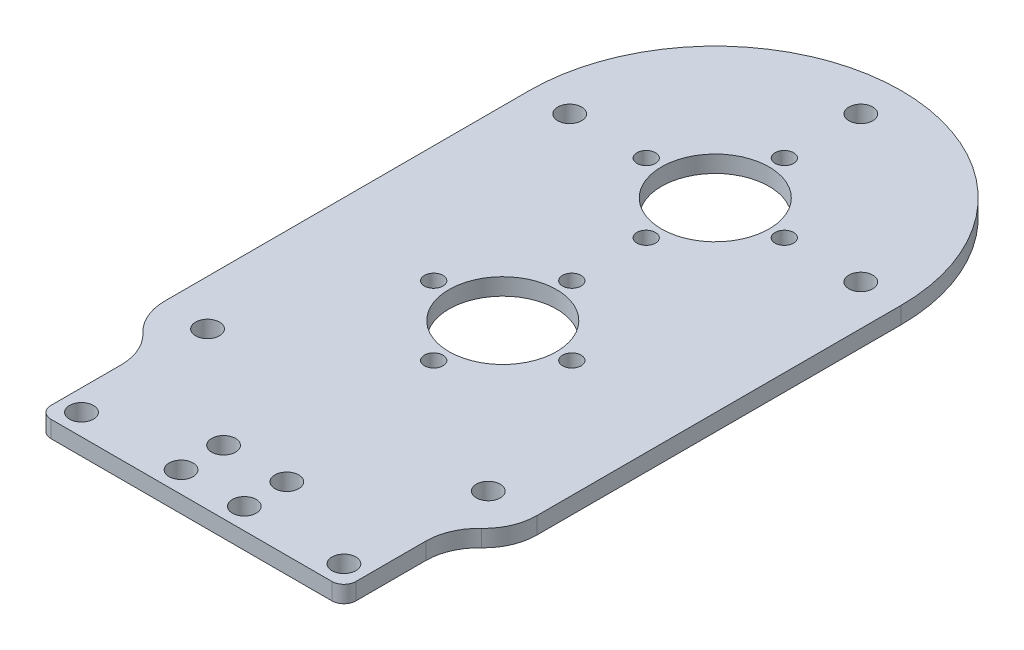
ISO-10303-21;
HEADER;
FILE_DESCRIPTION(('STEP AP214'),'2;1');
FILE_NAME('part.step','',(''),(''),'','','');
FILE_SCHEMA(('AUTOMOTIVE_DESIGN { 1 0 10303 214 1 1 1 1 }'));
ENDSEC;
DATA;
#1=APPLICATION_CONTEXT('core data for automotive mechanical design processes');
#2=APPLICATION_PROTOCOL_DEFINITION('international standard','automotive_design',2000,#1);
#3=PRODUCT_CONTEXT('',#1,'mechanical');
#4=PRODUCT('Part','Part','',(#3));
#5=PRODUCT_RELATED_PRODUCT_CATEGORY('part','',(#4));
#6=PRODUCT_DEFINITION_FORMATION('','',#4);
#7=PRODUCT_DEFINITION_CONTEXT('part definition',#1,'design');
#8=PRODUCT_DEFINITION('design','',#6,#7);
#9=PRODUCT_DEFINITION_SHAPE('','',#8);
#10=(LENGTH_UNIT() NAMED_UNIT(*) SI_UNIT(.MILLI.,.METRE.));
#11=(NAMED_UNIT(*) PLANE_ANGLE_UNIT() SI_UNIT($,.RADIAN.));
#12=(NAMED_UNIT(*) SI_UNIT($,.STERADIAN.) SOLID_ANGLE_UNIT());
#13=UNCERTAINTY_MEASURE_WITH_UNIT(LENGTH_MEASURE(1.E-05),#10,'distance_accuracy_value','');
#14=(GEOMETRIC_REPRESENTATION_CONTEXT(3) GLOBAL_UNCERTAINTY_ASSIGNED_CONTEXT((#13)) GLOBAL_UNIT_ASSIGNED_CONTEXT((#10,
#11,#12)) REPRESENTATION_CONTEXT('',''));
#15=CARTESIAN_POINT('',(0.,0.,0.));
#16=DIRECTION('',(0.,0.,1.));
#17=DIRECTION('',(1.,0.,0.));
#18=AXIS2_PLACEMENT_3D('',#15,#16,#17);
#19=CARTESIAN_POINT('',(38.7,217.525,43.1708613334971));
#20=DIRECTION('',(0.,1.,0.));
#21=DIRECTION('',(0.,0.,1.));
#22=AXIS2_PLACEMENT_3D('',#19,#20,#21);
#23=CYLINDRICAL_SURFACE('',#22,9.99999999999999);
#24=CARTESIAN_POINT('',(38.7,220.7,43.1708613334971));
#25=DIRECTION('',(0.,-1.,0.));
#26=DIRECTION('',(0.,0.,1.));
#27=AXIS2_PLACEMENT_3D('',#24,#25,#26);
#28=CIRCLE('',#27,9.99999999999999);
#29=CARTESIAN_POINT('',(28.7,220.7,43.1708613334971));
#30=VERTEX_POINT('',#29);
#31=CARTESIAN_POINT('',(31.85,220.7,35.8854306667485));
#32=VERTEX_POINT('',#31);
#33=EDGE_CURVE('E160',#30,#32,#28,.T.);
#34=ORIENTED_EDGE('',*,*,#33,.F.);
#35=DIRECTION('',(0.,1.,0.));
#36=VECTOR('',#35,1.);
#37=CARTESIAN_POINT('',(28.7,217.525,43.1708613334971));
#38=LINE('',#37,#36);
#39=CARTESIAN_POINT('',(28.7,217.525,43.1708613334971));
#40=VERTEX_POINT('',#39);
#41=EDGE_CURVE('E11',#40,#30,#38,.T.);
#42=ORIENTED_EDGE('',*,*,#41,.F.);
#43=CARTESIAN_POINT('',(38.7,217.525,43.1708613334971));
#44=DIRECTION('',(0.,-1.,0.));
#45=DIRECTION('',(0.,0.,1.));
#46=AXIS2_PLACEMENT_3D('',#43,#44,#45);
#47=CIRCLE('',#46,9.99999999999999);
#48=CARTESIAN_POINT('',(31.85,217.525,35.8854306667485));
#49=VERTEX_POINT('',#48);
#50=EDGE_CURVE('E193',#40,#49,#47,.T.);
#51=ORIENTED_EDGE('',*,*,#50,.T.);
#52=DIRECTION('',(0.,1.,0.));
#53=VECTOR('',#52,1.);
#54=CARTESIAN_POINT('',(31.85,217.525,35.8854306667485));
#55=LINE('',#54,#53);
#56=EDGE_CURVE('E42',#49,#32,#55,.T.);
#57=ORIENTED_EDGE('',*,*,#56,.T.);
#58=EDGE_LOOP('',(#34,#42,#51,#57));
#59=FACE_BOUND('',#58,.T.);
#60=ADVANCED_FACE('F39',(#59),#23,.F.);
#61=CARTESIAN_POINT('',(28.7,217.525,43.1708613334971));
#62=DIRECTION('',(1.,0.,0.));
#63=DIRECTION('',(0.,0.,-1.));
#64=AXIS2_PLACEMENT_3D('',#61,#62,#63);
#65=PLANE('',#64);
#66=DIRECTION('',(0.,0.,-1.));
#67=VECTOR('',#66,1.);
#68=CARTESIAN_POINT('',(28.7,220.7,43.1708613334971));
#69=LINE('',#68,#67);
#70=CARTESIAN_POINT('',(28.7,220.7,56.35));
#71=VERTEX_POINT('',#70);
#72=EDGE_CURVE('E191',#71,#30,#69,.T.);
#73=ORIENTED_EDGE('',*,*,#72,.F.);
#74=DIRECTION('',(0.,1.,0.));
#75=VECTOR('',#74,1.);
#76=CARTESIAN_POINT('',(28.7,217.525,56.35));
#77=LINE('',#76,#75);
#78=CARTESIAN_POINT('',(28.7,217.525,56.35));
#79=VERTEX_POINT('',#78);
#80=EDGE_CURVE('E48',#79,#71,#77,.T.);
#81=ORIENTED_EDGE('',*,*,#80,.F.);
#82=DIRECTION('',(0.,0.,-1.));
#83=VECTOR('',#82,1.);
#84=CARTESIAN_POINT('',(28.7,217.525,43.1708613334971));
#85=LINE('',#84,#83);
#86=EDGE_CURVE('E150',#79,#40,#85,.T.);
#87=ORIENTED_EDGE('',*,*,#86,.T.);
#88=ORIENTED_EDGE('',*,*,#41,.T.);
#89=EDGE_LOOP('',(#73,#81,#87,#88));
#90=FACE_BOUND('',#89,.T.);
#91=ADVANCED_FACE('F214',(#90),#65,.T.);
#92=CARTESIAN_POINT('',(26.45,217.525,56.35));
#93=DIRECTION('',(0.,1.,0.));
#94=DIRECTION('',(0.,0.,1.));
#95=AXIS2_PLACEMENT_3D('',#92,#93,#94);
#96=CYLINDRICAL_SURFACE('',#95,2.25);
#97=CARTESIAN_POINT('',(26.45,220.7,56.35));
#98=DIRECTION('',(0.,1.,0.));
#99=DIRECTION('',(0.,0.,1.));
#100=AXIS2_PLACEMENT_3D('',#97,#98,#99);
#101=CIRCLE('',#100,2.25);
#102=CARTESIAN_POINT('',(26.45,220.7,58.6));
#103=VERTEX_POINT('',#102);
#104=EDGE_CURVE('E137',#103,#71,#101,.T.);
#105=ORIENTED_EDGE('',*,*,#104,.F.);
#106=DIRECTION('',(0.,1.,0.));
#107=VECTOR('',#106,1.);
#108=CARTESIAN_POINT('',(26.45,217.525,58.6));
#109=LINE('',#108,#107);
#110=CARTESIAN_POINT('',(26.45,217.525,58.6));
#111=VERTEX_POINT('',#110);
#112=EDGE_CURVE('E132',#111,#103,#109,.T.);
#113=ORIENTED_EDGE('',*,*,#112,.F.);
#114=CARTESIAN_POINT('',(26.45,217.525,56.35));
#115=DIRECTION('',(0.,1.,0.));
#116=DIRECTION('',(0.,0.,1.));
#117=AXIS2_PLACEMENT_3D('',#114,#115,#116);
#118=CIRCLE('',#117,2.25);
#119=EDGE_CURVE('E135',#111,#79,#118,.T.);
#120=ORIENTED_EDGE('',*,*,#119,.T.);
#121=ORIENTED_EDGE('',*,*,#80,.T.);
#122=EDGE_LOOP('',(#105,#113,#120,#121));
#123=FACE_BOUND('',#122,.T.);
#124=ADVANCED_FACE('F134',(#123),#96,.T.);
#125=CARTESIAN_POINT('',(-26.45,217.525,58.6));
#126=DIRECTION('',(0.,0.,1.));
#127=DIRECTION('',(1.,0.,0.));
#128=AXIS2_PLACEMENT_3D('',#125,#126,#127);
#129=PLANE('',#128);
#130=DIRECTION('',(1.,0.,0.));
#131=VECTOR('',#130,1.);
#132=CARTESIAN_POINT('',(-26.45,220.7,58.6));
#133=LINE('',#132,#131);
#134=CARTESIAN_POINT('',(-26.45,220.7,58.6));
#135=VERTEX_POINT('',#134);
#136=EDGE_CURVE('E188',#135,#103,#133,.T.);
#137=ORIENTED_EDGE('',*,*,#136,.F.);
#138=DIRECTION('',(0.,1.,0.));
#139=VECTOR('',#138,1.);
#140=CARTESIAN_POINT('',(-26.45,217.525,58.6));
#141=LINE('',#140,#139);
#142=CARTESIAN_POINT('',(-26.45,217.525,58.6));
#143=VERTEX_POINT('',#142);
#144=EDGE_CURVE('E142',#143,#135,#141,.T.);
#145=ORIENTED_EDGE('',*,*,#144,.F.);
#146=DIRECTION('',(1.,0.,0.));
#147=VECTOR('',#146,1.);
#148=CARTESIAN_POINT('',(-26.45,217.525,58.6));
#149=LINE('',#148,#147);
#150=EDGE_CURVE('E148',#143,#111,#149,.T.);
#151=ORIENTED_EDGE('',*,*,#150,.T.);
#152=ORIENTED_EDGE('',*,*,#112,.T.);
#153=EDGE_LOOP('',(#137,#145,#151,#152));
#154=FACE_BOUND('',#153,.T.);
#155=ADVANCED_FACE('F152',(#154),#129,.T.);
#156=CARTESIAN_POINT('',(-26.45,217.525,56.35));
#157=DIRECTION('',(0.,1.,0.));
#158=DIRECTION('',(0.,0.,1.));
#159=AXIS2_PLACEMENT_3D('',#156,#157,#158);
#160=CYLINDRICAL_SURFACE('',#159,2.25);
#161=CARTESIAN_POINT('',(-26.45,220.7,56.35));
#162=DIRECTION('',(0.,1.,0.));
#163=DIRECTION('',(0.,0.,1.));
#164=AXIS2_PLACEMENT_3D('',#161,#162,#163);
#165=CIRCLE('',#164,2.25);
#166=CARTESIAN_POINT('',(-28.7,220.7,56.35));
#167=VERTEX_POINT('',#166);
#168=EDGE_CURVE('E185',#167,#135,#165,.T.);
#169=ORIENTED_EDGE('',*,*,#168,.F.);
#170=DIRECTION('',(0.,1.,0.));
#171=VECTOR('',#170,1.);
#172=CARTESIAN_POINT('',(-28.7,217.525,56.35));
#173=LINE('',#172,#171);
#174=CARTESIAN_POINT('',(-28.7,217.525,56.35));
#175=VERTEX_POINT('',#174);
#176=EDGE_CURVE('E197',#175,#167,#173,.T.);
#177=ORIENTED_EDGE('',*,*,#176,.F.);
#178=CARTESIAN_POINT('',(-26.45,217.525,56.35));
#179=DIRECTION('',(0.,1.,0.));
#180=DIRECTION('',(0.,0.,1.));
#181=AXIS2_PLACEMENT_3D('',#178,#179,#180);
#182=CIRCLE('',#181,2.25);
#183=EDGE_CURVE('E153',#175,#143,#182,.T.);
#184=ORIENTED_EDGE('',*,*,#183,.T.);
#185=ORIENTED_EDGE('',*,*,#144,.T.);
#186=EDGE_LOOP('',(#169,#177,#184,#185));
#187=FACE_BOUND('',#186,.T.);
#188=ADVANCED_FACE('F227',(#187),#160,.T.);
#189=CARTESIAN_POINT('',(-28.7,217.525,43.1708613334971));
#190=DIRECTION('',(-1.,0.,0.));
#191=DIRECTION('',(0.,0.,1.));
#192=AXIS2_PLACEMENT_3D('',#189,#190,#191);
#193=PLANE('',#192);
#194=DIRECTION('',(0.,0.,1.));
#195=VECTOR('',#194,1.);
#196=CARTESIAN_POINT('',(-28.7,220.7,43.1708613334971));
#197=LINE('',#196,#195);
#198=CARTESIAN_POINT('',(-28.7,220.7,43.1708613334971));
#199=VERTEX_POINT('',#198);
#200=EDGE_CURVE('E182',#199,#167,#197,.T.);
#201=ORIENTED_EDGE('',*,*,#200,.F.);
#202=DIRECTION('',(0.,1.,0.));
#203=VECTOR('',#202,1.);
#204=CARTESIAN_POINT('',(-28.7,217.525,43.1708613334971));
#205=LINE('',#204,#203);
#206=CARTESIAN_POINT('',(-28.7,217.525,43.1708613334971));
#207=VERTEX_POINT('',#206);
#208=EDGE_CURVE('E199',#207,#199,#205,.T.);
#209=ORIENTED_EDGE('',*,*,#208,.F.);
#210=DIRECTION('',(0.,0.,1.));
#211=VECTOR('',#210,1.);
#212=CARTESIAN_POINT('',(-28.7,217.525,43.1708613334971));
#213=LINE('',#212,#211);
#214=EDGE_CURVE('E155',#207,#175,#213,.T.);
#215=ORIENTED_EDGE('',*,*,#214,.T.);
#216=ORIENTED_EDGE('',*,*,#176,.T.);
#217=EDGE_LOOP('',(#201,#209,#215,#216));
#218=FACE_BOUND('',#217,.T.);
#219=ADVANCED_FACE('F230',(#218),#193,.T.);
#220=CARTESIAN_POINT('',(-38.7,217.525,43.1708613334971));
#221=DIRECTION('',(0.,1.,0.));
#222=DIRECTION('',(0.,0.,1.));
#223=AXIS2_PLACEMENT_3D('',#220,#221,#222);
#224=CYLINDRICAL_SURFACE('',#223,9.99999999999999);
#225=CARTESIAN_POINT('',(-38.7,220.7,43.1708613334971));
#226=DIRECTION('',(0.,-1.,0.));
#227=DIRECTION('',(0.,0.,1.));
#228=AXIS2_PLACEMENT_3D('',#225,#226,#227);
#229=CIRCLE('',#228,9.99999999999999);
#230=CARTESIAN_POINT('',(-31.85,220.7,35.8854306667485));
#231=VERTEX_POINT('',#230);
#232=EDGE_CURVE('E179',#231,#199,#229,.T.);
#233=ORIENTED_EDGE('',*,*,#232,.F.);
#234=DIRECTION('',(0.,1.,0.));
#235=VECTOR('',#234,1.);
#236=CARTESIAN_POINT('',(-31.85,217.525,35.8854306667485));
#237=LINE('',#236,#235);
#238=CARTESIAN_POINT('',(-31.85,217.525,35.8854306667485));
#239=VERTEX_POINT('',#238);
#240=EDGE_CURVE('E201',#239,#231,#237,.T.);
#241=ORIENTED_EDGE('',*,*,#240,.F.);
#242=CARTESIAN_POINT('',(-38.7,217.525,43.1708613334971));
#243=DIRECTION('',(0.,-1.,0.));
#244=DIRECTION('',(0.,0.,1.));
#245=AXIS2_PLACEMENT_3D('',#242,#243,#244);
#246=CIRCLE('',#245,9.99999999999999);
#247=EDGE_CURVE('E492',#239,#207,#246,.T.);
#248=ORIENTED_EDGE('',*,*,#247,.T.);
#249=ORIENTED_EDGE('',*,*,#208,.T.);
#250=EDGE_LOOP('',(#233,#241,#248,#249));
#251=FACE_BOUND('',#250,.T.);
#252=ADVANCED_FACE('F234',(#251),#224,.F.);
#253=CARTESIAN_POINT('',(-25.,217.525,28.6));
#254=DIRECTION('',(0.,1.,0.));
#255=DIRECTION('',(0.,0.,1.));
#256=AXIS2_PLACEMENT_3D('',#253,#254,#255);
#257=CYLINDRICAL_SURFACE('',#256,10.);
#258=CARTESIAN_POINT('',(-25.,220.7,28.6));
#259=DIRECTION('',(0.,1.,0.));
#260=DIRECTION('',(0.,0.,1.));
#261=AXIS2_PLACEMENT_3D('',#258,#259,#260);
#262=CIRCLE('',#261,10.);
#263=CARTESIAN_POINT('',(-35.,220.7,28.5999999999999));
#264=VERTEX_POINT('',#263);
#265=EDGE_CURVE('E176',#264,#231,#262,.T.);
#266=ORIENTED_EDGE('',*,*,#265,.F.);
#267=DIRECTION('',(0.,1.,0.));
#268=VECTOR('',#267,1.);
#269=CARTESIAN_POINT('',(-35.,217.525,28.5999999999999));
#270=LINE('',#269,#268);
#271=CARTESIAN_POINT('',(-35.,217.525,28.5999999999999));
#272=VERTEX_POINT('',#271);
#273=EDGE_CURVE('E203',#272,#264,#270,.T.);
#274=ORIENTED_EDGE('',*,*,#273,.F.);
#275=CARTESIAN_POINT('',(-25.,217.525,28.6));
#276=DIRECTION('',(0.,1.,0.));
#277=DIRECTION('',(0.,0.,1.));
#278=AXIS2_PLACEMENT_3D('',#275,#276,#277);
#279=CIRCLE('',#278,10.);
#280=EDGE_CURVE('E489',#272,#239,#279,.T.);
#281=ORIENTED_EDGE('',*,*,#280,.T.);
#282=ORIENTED_EDGE('',*,*,#240,.T.);
#283=EDGE_LOOP('',(#266,#274,#281,#282));
#284=FACE_BOUND('',#283,.T.);
#285=ADVANCED_FACE('F238',(#284),#257,.T.);
#286=CARTESIAN_POINT('',(-35.,217.525,28.5963697313921));
#287=DIRECTION('',(-1.,0.,-1.9113995832185E-12));
#288=DIRECTION('',(-1.9113995832185E-12,0.,1.));
#289=AXIS2_PLACEMENT_3D('',#286,#287,#288);
#290=PLANE('',#289);
#291=DIRECTION('',(-1.9113995832185E-12,0.,1.));
#292=VECTOR('',#291,1.);
#293=CARTESIAN_POINT('',(-35.,220.7,28.5963697313921));
#294=LINE('',#293,#292);
#295=CARTESIAN_POINT('',(-35.,220.7,-40.));
#296=VERTEX_POINT('',#295);
#297=EDGE_CURVE('E173',#296,#264,#294,.T.);
#298=ORIENTED_EDGE('',*,*,#297,.F.);
#299=DIRECTION('',(0.,1.,0.));
#300=VECTOR('',#299,1.);
#301=CARTESIAN_POINT('',(-35.,217.525,-40.));
#302=LINE('',#301,#300);
#303=CARTESIAN_POINT('',(-35.,217.525,-40.));
#304=VERTEX_POINT('',#303);
#305=EDGE_CURVE('E205',#304,#296,#302,.T.);
#306=ORIENTED_EDGE('',*,*,#305,.F.);
#307=DIRECTION('',(0.,0.,1.));
#308=VECTOR('',#307,1.);
#309=CARTESIAN_POINT('',(-35.,217.525,-40.));
#310=LINE('',#309,#308);
#311=EDGE_CURVE('E487',#304,#272,#310,.T.);
#312=ORIENTED_EDGE('',*,*,#311,.T.);
#313=ORIENTED_EDGE('',*,*,#273,.T.);
#314=EDGE_LOOP('',(#298,#306,#312,#313));
#315=FACE_BOUND('',#314,.T.);
#316=ADVANCED_FACE('F242',(#315),#290,.T.);
#317=CARTESIAN_POINT('',(0.,217.525,-40.));
#318=DIRECTION('',(0.,1.,0.));
#319=DIRECTION('',(0.,0.,1.));
#320=AXIS2_PLACEMENT_3D('',#317,#318,#319);
#321=CYLINDRICAL_SURFACE('',#320,35.);
#322=CARTESIAN_POINT('',(0.,220.7,-40.));
#323=DIRECTION('',(0.,1.,0.));
#324=DIRECTION('',(0.,0.,1.));
#325=AXIS2_PLACEMENT_3D('',#322,#323,#324);
#326=CIRCLE('',#325,35.);
#327=CARTESIAN_POINT('',(35.,220.7,-40.));
#328=VERTEX_POINT('',#327);
#329=EDGE_CURVE('E170',#328,#296,#326,.T.);
#330=ORIENTED_EDGE('',*,*,#329,.F.);
#331=DIRECTION('',(0.,1.,0.));
#332=VECTOR('',#331,1.);
#333=CARTESIAN_POINT('',(35.,217.525,-40.));
#334=LINE('',#333,#332);
#335=CARTESIAN_POINT('',(35.,217.525,-40.));
#336=VERTEX_POINT('',#335);
#337=EDGE_CURVE('E208',#336,#328,#334,.T.);
#338=ORIENTED_EDGE('',*,*,#337,.F.);
#339=CARTESIAN_POINT('',(0.,217.525,-40.));
#340=DIRECTION('',(0.,1.,0.));
#341=DIRECTION('',(0.,0.,1.));
#342=AXIS2_PLACEMENT_3D('',#339,#340,#341);
#343=CIRCLE('',#342,35.);
#344=EDGE_CURVE('E484',#336,#304,#343,.T.);
#345=ORIENTED_EDGE('',*,*,#344,.T.);
#346=ORIENTED_EDGE('',*,*,#305,.T.);
#347=EDGE_LOOP('',(#330,#338,#345,#346));
#348=FACE_BOUND('',#347,.T.);
#349=ADVANCED_FACE('F246',(#348),#321,.T.);
#350=CARTESIAN_POINT('',(35.,217.525,-40.));
#351=DIRECTION('',(1.,0.,0.));
#352=DIRECTION('',(0.,0.,-1.));
#353=AXIS2_PLACEMENT_3D('',#350,#351,#352);
#354=PLANE('',#353);
#355=DIRECTION('',(0.,0.,-1.));
#356=VECTOR('',#355,1.);
#357=CARTESIAN_POINT('',(35.,220.7,-40.));
#358=LINE('',#357,#356);
#359=CARTESIAN_POINT('',(35.,220.7,28.6));
#360=VERTEX_POINT('',#359);
#361=EDGE_CURVE('E167',#360,#328,#358,.T.);
#362=ORIENTED_EDGE('',*,*,#361,.F.);
#363=DIRECTION('',(0.,1.,0.));
#364=VECTOR('',#363,1.);
#365=CARTESIAN_POINT('',(35.,217.525,28.6));
#366=LINE('',#365,#364);
#367=CARTESIAN_POINT('',(35.,217.525,28.6));
#368=VERTEX_POINT('',#367);
#369=EDGE_CURVE('E209',#368,#360,#366,.T.);
#370=ORIENTED_EDGE('',*,*,#369,.F.);
#371=DIRECTION('',(0.,0.,-1.));
#372=VECTOR('',#371,1.);
#373=CARTESIAN_POINT('',(35.,217.525,-0.432706106175311));
#374=LINE('',#373,#372);
#375=EDGE_CURVE('E482',#368,#336,#374,.T.);
#376=ORIENTED_EDGE('',*,*,#375,.T.);
#377=ORIENTED_EDGE('',*,*,#337,.T.);
#378=EDGE_LOOP('',(#362,#370,#376,#377));
#379=FACE_BOUND('',#378,.T.);
#380=ADVANCED_FACE('F250',(#379),#354,.T.);
#381=CARTESIAN_POINT('',(25.,217.525,28.6));
#382=DIRECTION('',(0.,1.,0.));
#383=DIRECTION('',(0.,0.,1.));
#384=AXIS2_PLACEMENT_3D('',#381,#382,#383);
#385=CYLINDRICAL_SURFACE('',#384,10.);
#386=CARTESIAN_POINT('',(25.,220.7,28.6));
#387=DIRECTION('',(0.,1.,0.));
#388=DIRECTION('',(0.,0.,1.));
#389=AXIS2_PLACEMENT_3D('',#386,#387,#388);
#390=CIRCLE('',#389,10.);
#391=EDGE_CURVE('E163',#32,#360,#390,.T.);
#392=ORIENTED_EDGE('',*,*,#391,.F.);
#393=ORIENTED_EDGE('',*,*,#56,.F.);
#394=CARTESIAN_POINT('',(25.,217.525,28.6));
#395=DIRECTION('',(0.,1.,0.));
#396=DIRECTION('',(0.,0.,1.));
#397=AXIS2_PLACEMENT_3D('',#394,#395,#396);
#398=CIRCLE('',#397,10.);
#399=EDGE_CURVE('E480',#49,#368,#398,.T.);
#400=ORIENTED_EDGE('',*,*,#399,.T.);
#401=ORIENTED_EDGE('',*,*,#369,.T.);
#402=EDGE_LOOP('',(#392,#393,#400,#401));
#403=FACE_BOUND('',#402,.T.);
#404=ADVANCED_FACE('F211',(#403),#385,.T.);
#405=CARTESIAN_POINT('',(38.7,217.525,43.1708613334971));
#406=DIRECTION('',(0.,1.,0.));
#407=DIRECTION('',(0.,0.,1.));
#408=AXIS2_PLACEMENT_3D('',#405,#406,#407);
#409=PLANE('',#408);
#410=CARTESIAN_POINT('',(-5.94999999999999,217.525,46.6));
#411=DIRECTION('',(0.,1.,0.));
#412=DIRECTION('',(0.,0.,1.));
#413=AXIS2_PLACEMENT_3D('',#410,#411,#412);
#414=CIRCLE('',#413,2.25);
#415=CARTESIAN_POINT('',(-5.94999999999999,217.525,48.85));
#416=VERTEX_POINT('',#415);
#417=EDGE_CURVE('E353',#416,#416,#414,.T.);
#418=ORIENTED_EDGE('',*,*,#417,.T.);
#419=EDGE_LOOP('',(#418));
#420=FACE_BOUND('',#419,.T.);
#421=CARTESIAN_POINT('',(5.94999999999999,217.525,46.6));
#422=DIRECTION('',(0.,1.,0.));
#423=DIRECTION('',(0.,0.,1.));
#424=AXIS2_PLACEMENT_3D('',#421,#422,#423);
#425=CIRCLE('',#424,2.25000000000001);
#426=CARTESIAN_POINT('',(5.94999999999999,217.525,48.85));
#427=VERTEX_POINT('',#426);
#428=EDGE_CURVE('E361',#427,#427,#425,.T.);
#429=ORIENTED_EDGE('',*,*,#428,.T.);
#430=EDGE_LOOP('',(#429));
#431=FACE_BOUND('',#430,.T.);
#432=CARTESIAN_POINT('',(-5.94999999999999,217.525,54.6));
#433=DIRECTION('',(0.,1.,0.));
#434=DIRECTION('',(0.,0.,1.));
#435=AXIS2_PLACEMENT_3D('',#432,#433,#434);
#436=CIRCLE('',#435,2.25);
#437=CARTESIAN_POINT('',(-5.94999999999999,217.525,56.85));
#438=VERTEX_POINT('',#437);
#439=EDGE_CURVE('E367',#438,#438,#436,.T.);
#440=ORIENTED_EDGE('',*,*,#439,.T.);
#441=EDGE_LOOP('',(#440));
#442=FACE_BOUND('',#441,.T.);
#443=CARTESIAN_POINT('',(5.94999999999999,217.525,54.6));
#444=DIRECTION('',(0.,1.,0.));
#445=DIRECTION('',(0.,0.,1.));
#446=AXIS2_PLACEMENT_3D('',#443,#444,#445);
#447=CIRCLE('',#446,2.25000000000001);
#448=CARTESIAN_POINT('',(5.94999999999999,217.525,56.85));
#449=VERTEX_POINT('',#448);
#450=EDGE_CURVE('E373',#449,#449,#447,.T.);
#451=ORIENTED_EDGE('',*,*,#450,.T.);
#452=EDGE_LOOP('',(#451));
#453=FACE_BOUND('',#452,.T.);
#454=CARTESIAN_POINT('',(-27.4,217.525,-40.));
#455=DIRECTION('',(0.,1.,0.));
#456=DIRECTION('',(0.,0.,1.));
#457=AXIS2_PLACEMENT_3D('',#454,#455,#456);
#458=CIRCLE('',#457,2.25);
#459=CARTESIAN_POINT('',(-27.4,217.525,-37.75));
#460=VERTEX_POINT('',#459);
#461=EDGE_CURVE('E379',#460,#460,#458,.T.);
#462=ORIENTED_EDGE('',*,*,#461,.T.);
#463=EDGE_LOOP('',(#462));
#464=FACE_BOUND('',#463,.T.);
#465=CARTESIAN_POINT('',(-13.,217.525,-40.));
#466=DIRECTION('',(0.,1.,0.));
#467=DIRECTION('',(0.,0.,1.));
#468=AXIS2_PLACEMENT_3D('',#465,#466,#467);
#469=CIRCLE('',#468,1.75000000000003);
#470=CARTESIAN_POINT('',(-13.,217.525,-38.25));
#471=VERTEX_POINT('',#470);
#472=EDGE_CURVE('E385',#471,#471,#469,.T.);
#473=ORIENTED_EDGE('',*,*,#472,.T.);
#474=EDGE_LOOP('',(#473));
#475=FACE_BOUND('',#474,.T.);
#476=CARTESIAN_POINT('',(0.,217.525,-40.));
#477=DIRECTION('',(0.,1.,0.));
#478=DIRECTION('',(0.,0.,1.));
#479=AXIS2_PLACEMENT_3D('',#476,#477,#478);
#480=CIRCLE('',#479,10.125);
#481=CARTESIAN_POINT('',(0.,217.525,-29.875));
#482=VERTEX_POINT('',#481);
#483=EDGE_CURVE('E391',#482,#482,#480,.T.);
#484=ORIENTED_EDGE('',*,*,#483,.T.);
#485=EDGE_LOOP('',(#484));
#486=FACE_BOUND('',#485,.T.);
#487=CARTESIAN_POINT('',(0.,217.525,-53.));
#488=DIRECTION('',(0.,1.,0.));
#489=DIRECTION('',(0.,0.,1.));
#490=AXIS2_PLACEMENT_3D('',#487,#488,#489);
#491=CIRCLE('',#490,1.75000000000003);
#492=CARTESIAN_POINT('',(0.,217.525,-51.25));
#493=VERTEX_POINT('',#492);
#494=EDGE_CURVE('E397',#493,#493,#491,.T.);
#495=ORIENTED_EDGE('',*,*,#494,.T.);
#496=EDGE_LOOP('',(#495));
#497=FACE_BOUND('',#496,.T.);
#498=CARTESIAN_POINT('',(0.,217.525,-67.4));
#499=DIRECTION('',(0.,1.,0.));
#500=DIRECTION('',(0.,0.,1.));
#501=AXIS2_PLACEMENT_3D('',#498,#499,#500);
#502=CIRCLE('',#501,2.25);
#503=CARTESIAN_POINT('',(0.,217.525,-65.15));
#504=VERTEX_POINT('',#503);
#505=EDGE_CURVE('E403',#504,#504,#502,.T.);
#506=ORIENTED_EDGE('',*,*,#505,.T.);
#507=EDGE_LOOP('',(#506));
#508=FACE_BOUND('',#507,.T.);
#509=CARTESIAN_POINT('',(13.,217.525,-40.));
#510=DIRECTION('',(0.,1.,0.));
#511=DIRECTION('',(0.,0.,1.));
#512=AXIS2_PLACEMENT_3D('',#509,#510,#511);
#513=CIRCLE('',#512,1.74999999999999);
#514=CARTESIAN_POINT('',(13.,217.525,-38.25));
#515=VERTEX_POINT('',#514);
#516=EDGE_CURVE('E409',#515,#515,#513,.T.);
#517=ORIENTED_EDGE('',*,*,#516,.T.);
#518=EDGE_LOOP('',(#517));
#519=FACE_BOUND('',#518,.T.);
#520=CARTESIAN_POINT('',(27.4,217.525,-40.));
#521=DIRECTION('',(0.,1.,0.));
#522=DIRECTION('',(0.,0.,1.));
#523=AXIS2_PLACEMENT_3D('',#520,#521,#522);
#524=CIRCLE('',#523,2.25);
#525=CARTESIAN_POINT('',(27.4,217.525,-37.75));
#526=VERTEX_POINT('',#525);
#527=EDGE_CURVE('E415',#526,#526,#524,.T.);
#528=ORIENTED_EDGE('',*,*,#527,.T.);
#529=EDGE_LOOP('',(#528));
#530=FACE_BOUND('',#529,.T.);
#531=CARTESIAN_POINT('',(0.,217.525,-27.));
#532=DIRECTION('',(0.,1.,0.));
#533=DIRECTION('',(0.,0.,1.));
#534=AXIS2_PLACEMENT_3D('',#531,#532,#533);
#535=CIRCLE('',#534,1.75);
#536=CARTESIAN_POINT('',(0.,217.525,-25.25));
#537=VERTEX_POINT('',#536);
#538=EDGE_CURVE('E421',#537,#537,#535,.T.);
#539=ORIENTED_EDGE('',*,*,#538,.T.);
#540=EDGE_LOOP('',(#539));
#541=FACE_BOUND('',#540,.T.);
#542=CARTESIAN_POINT('',(0.,217.525,0.));
#543=DIRECTION('',(0.,1.,0.));
#544=DIRECTION('',(0.,0.,1.));
#545=AXIS2_PLACEMENT_3D('',#542,#543,#544);
#546=CIRCLE('',#545,10.125);
#547=CARTESIAN_POINT('',(0.,217.525,10.125));
#548=VERTEX_POINT('',#547);
#549=EDGE_CURVE('E427',#548,#548,#546,.T.);
#550=ORIENTED_EDGE('',*,*,#549,.T.);
#551=EDGE_LOOP('',(#550));
#552=FACE_BOUND('',#551,.T.);
#553=CARTESIAN_POINT('',(0.,217.525,-13.));
#554=DIRECTION('',(0.,1.,0.));
#555=DIRECTION('',(0.,0.,1.));
#556=AXIS2_PLACEMENT_3D('',#553,#554,#555);
#557=CIRCLE('',#556,1.75);
#558=CARTESIAN_POINT('',(0.,217.525,-11.25));
#559=VERTEX_POINT('',#558);
#560=EDGE_CURVE('E433',#559,#559,#557,.T.);
#561=ORIENTED_EDGE('',*,*,#560,.T.);
#562=EDGE_LOOP('',(#561));
#563=FACE_BOUND('',#562,.T.);
#564=CARTESIAN_POINT('',(-12.9999999999999,217.525,0.));
#565=DIRECTION('',(0.,1.,0.));
#566=DIRECTION('',(0.,0.,1.));
#567=AXIS2_PLACEMENT_3D('',#564,#565,#566);
#568=CIRCLE('',#567,1.75);
#569=CARTESIAN_POINT('',(-12.9999999999999,217.525,1.75000000000004));
#570=VERTEX_POINT('',#569);
#571=EDGE_CURVE('E439',#570,#570,#568,.T.);
#572=ORIENTED_EDGE('',*,*,#571,.T.);
#573=EDGE_LOOP('',(#572));
#574=FACE_BOUND('',#573,.T.);
#575=CARTESIAN_POINT('',(1.37209959955431E-13,217.525,13.));
#576=DIRECTION('',(0.,1.,0.));
#577=DIRECTION('',(0.,0.,1.));
#578=AXIS2_PLACEMENT_3D('',#575,#576,#577);
#579=CIRCLE('',#578,1.75);
#580=CARTESIAN_POINT('',(1.37209959955431E-13,217.525,14.75));
#581=VERTEX_POINT('',#580);
#582=EDGE_CURVE('E445',#581,#581,#579,.T.);
#583=ORIENTED_EDGE('',*,*,#582,.T.);
#584=EDGE_LOOP('',(#583));
#585=FACE_BOUND('',#584,.T.);
#586=CARTESIAN_POINT('',(13.0000000000001,217.525,0.));
#587=DIRECTION('',(0.,1.,0.));
#588=DIRECTION('',(0.,0.,1.));
#589=AXIS2_PLACEMENT_3D('',#586,#587,#588);
#590=CIRCLE('',#589,1.75);
#591=CARTESIAN_POINT('',(13.0000000000001,217.525,1.75));
#592=VERTEX_POINT('',#591);
#593=EDGE_CURVE('E451',#592,#592,#590,.T.);
#594=ORIENTED_EDGE('',*,*,#593,.T.);
#595=EDGE_LOOP('',(#594));
#596=FACE_BOUND('',#595,.T.);
#597=CARTESIAN_POINT('',(26.4254274471913,217.525,29.1434714131881));
#598=DIRECTION('',(0.,1.,0.));
#599=DIRECTION('',(0.,0.,1.));
#600=AXIS2_PLACEMENT_3D('',#597,#598,#599);
#601=CIRCLE('',#600,2.25);
#602=CARTESIAN_POINT('',(26.4254274471913,217.525,31.3934714131881));
#603=VERTEX_POINT('',#602);
#604=EDGE_CURVE('E457',#603,#603,#601,.T.);
#605=ORIENTED_EDGE('',*,*,#604,.T.);
#606=EDGE_LOOP('',(#605));
#607=FACE_BOUND('',#606,.T.);
#608=CARTESIAN_POINT('',(-26.4254274471913,217.525,29.1434714131881));
#609=DIRECTION('',(0.,1.,0.));
#610=DIRECTION('',(0.,0.,1.));
#611=AXIS2_PLACEMENT_3D('',#608,#609,#610);
#612=CIRCLE('',#611,2.25);
#613=CARTESIAN_POINT('',(-26.4254274471913,217.525,31.3934714131881));
#614=VERTEX_POINT('',#613);
#615=EDGE_CURVE('E463',#614,#614,#612,.T.);
#616=ORIENTED_EDGE('',*,*,#615,.T.);
#617=EDGE_LOOP('',(#616));
#618=FACE_BOUND('',#617,.T.);
#619=CARTESIAN_POINT('',(-24.7,217.525,54.6));
#620=DIRECTION('',(0.,1.,0.));
#621=DIRECTION('',(0.,0.,1.));
#622=AXIS2_PLACEMENT_3D('',#619,#620,#621);
#623=CIRCLE('',#622,2.25);
#624=CARTESIAN_POINT('',(-24.7,217.525,56.85));
#625=VERTEX_POINT('',#624);
#626=EDGE_CURVE('E469',#625,#625,#623,.T.);
#627=ORIENTED_EDGE('',*,*,#626,.T.);
#628=EDGE_LOOP('',(#627));
#629=FACE_BOUND('',#628,.T.);
#630=CARTESIAN_POINT('',(24.7,217.525,54.6));
#631=DIRECTION('',(0.,1.,0.));
#632=DIRECTION('',(0.,0.,1.));
#633=AXIS2_PLACEMENT_3D('',#630,#631,#632);
#634=CIRCLE('',#633,2.24999999999999);
#635=CARTESIAN_POINT('',(24.7,217.525,56.85));
#636=VERTEX_POINT('',#635);
#637=EDGE_CURVE('E164',#636,#636,#634,.T.);
#638=ORIENTED_EDGE('',*,*,#637,.T.);
#639=EDGE_LOOP('',(#638));
#640=FACE_BOUND('',#639,.T.);
#641=ORIENTED_EDGE('',*,*,#50,.F.);
#642=ORIENTED_EDGE('',*,*,#86,.F.);
#643=ORIENTED_EDGE('',*,*,#119,.F.);
#644=ORIENTED_EDGE('',*,*,#150,.F.);
#645=ORIENTED_EDGE('',*,*,#183,.F.);
#646=ORIENTED_EDGE('',*,*,#214,.F.);
#647=ORIENTED_EDGE('',*,*,#247,.F.);
#648=ORIENTED_EDGE('',*,*,#280,.F.);
#649=ORIENTED_EDGE('',*,*,#311,.F.);
#650=ORIENTED_EDGE('',*,*,#344,.F.);
#651=ORIENTED_EDGE('',*,*,#375,.F.);
#652=ORIENTED_EDGE('',*,*,#399,.F.);
#653=EDGE_LOOP('',(#641,#642,#643,#644,#645,#646,#647,#648,#649,#650,#651,#652));
#654=FACE_BOUND('',#653,.T.);
#655=ADVANCED_FACE('F146',(#420,#431,#442,#453,#464,#475,#486,#497,#508,#519,#530,#541,#552,
#563,#574,#585,#596,#607,#618,#629,#640,#654),#409,.F.);
#656=CARTESIAN_POINT('',(38.7,220.7,43.1708613334971));
#657=DIRECTION('',(0.,1.,0.));
#658=DIRECTION('',(0.,0.,1.));
#659=AXIS2_PLACEMENT_3D('',#656,#657,#658);
#660=PLANE('',#659);
#661=CARTESIAN_POINT('',(-5.94999999999999,220.7,46.6));
#662=DIRECTION('',(0.,1.,0.));
#663=DIRECTION('',(0.,0.,1.));
#664=AXIS2_PLACEMENT_3D('',#661,#662,#663);
#665=CIRCLE('',#664,2.25);
#666=CARTESIAN_POINT('',(-5.94999999999999,220.7,48.85));
#667=VERTEX_POINT('',#666);
#668=EDGE_CURVE('E356',#667,#667,#665,.T.);
#669=ORIENTED_EDGE('',*,*,#668,.F.);
#670=EDGE_LOOP('',(#669));
#671=FACE_BOUND('',#670,.T.);
#672=CARTESIAN_POINT('',(5.94999999999999,220.7,46.6));
#673=DIRECTION('',(0.,1.,0.));
#674=DIRECTION('',(0.,0.,1.));
#675=AXIS2_PLACEMENT_3D('',#672,#673,#674);
#676=CIRCLE('',#675,2.25000000000001);
#677=CARTESIAN_POINT('',(5.94999999999999,220.7,48.85));
#678=VERTEX_POINT('',#677);
#679=EDGE_CURVE('E358',#678,#678,#676,.T.);
#680=ORIENTED_EDGE('',*,*,#679,.F.);
#681=EDGE_LOOP('',(#680));
#682=FACE_BOUND('',#681,.T.);
#683=CARTESIAN_POINT('',(-5.94999999999999,220.7,54.6));
#684=DIRECTION('',(0.,1.,0.));
#685=DIRECTION('',(0.,0.,1.));
#686=AXIS2_PLACEMENT_3D('',#683,#684,#685);
#687=CIRCLE('',#686,2.25);
#688=CARTESIAN_POINT('',(-5.94999999999999,220.7,56.85));
#689=VERTEX_POINT('',#688);
#690=EDGE_CURVE('E364',#689,#689,#687,.T.);
#691=ORIENTED_EDGE('',*,*,#690,.F.);
#692=EDGE_LOOP('',(#691));
#693=FACE_BOUND('',#692,.T.);
#694=CARTESIAN_POINT('',(5.94999999999999,220.7,54.6));
#695=DIRECTION('',(0.,1.,0.));
#696=DIRECTION('',(0.,0.,1.));
#697=AXIS2_PLACEMENT_3D('',#694,#695,#696);
#698=CIRCLE('',#697,2.25000000000001);
#699=CARTESIAN_POINT('',(5.94999999999999,220.7,56.85));
#700=VERTEX_POINT('',#699);
#701=EDGE_CURVE('E370',#700,#700,#698,.T.);
#702=ORIENTED_EDGE('',*,*,#701,.F.);
#703=EDGE_LOOP('',(#702));
#704=FACE_BOUND('',#703,.T.);
#705=CARTESIAN_POINT('',(-27.4,220.7,-40.));
#706=DIRECTION('',(0.,1.,0.));
#707=DIRECTION('',(0.,0.,1.));
#708=AXIS2_PLACEMENT_3D('',#705,#706,#707);
#709=CIRCLE('',#708,2.25);
#710=CARTESIAN_POINT('',(-27.4,220.7,-37.75));
#711=VERTEX_POINT('',#710);
#712=EDGE_CURVE('E376',#711,#711,#709,.T.);
#713=ORIENTED_EDGE('',*,*,#712,.F.);
#714=EDGE_LOOP('',(#713));
#715=FACE_BOUND('',#714,.T.);
#716=CARTESIAN_POINT('',(-13.,220.7,-40.));
#717=DIRECTION('',(0.,1.,0.));
#718=DIRECTION('',(0.,0.,1.));
#719=AXIS2_PLACEMENT_3D('',#716,#717,#718);
#720=CIRCLE('',#719,1.75000000000003);
#721=CARTESIAN_POINT('',(-13.,220.7,-38.25));
#722=VERTEX_POINT('',#721);
#723=EDGE_CURVE('E382',#722,#722,#720,.T.);
#724=ORIENTED_EDGE('',*,*,#723,.F.);
#725=EDGE_LOOP('',(#724));
#726=FACE_BOUND('',#725,.T.);
#727=CARTESIAN_POINT('',(0.,220.7,-40.));
#728=DIRECTION('',(0.,1.,0.));
#729=DIRECTION('',(0.,0.,1.));
#730=AXIS2_PLACEMENT_3D('',#727,#728,#729);
#731=CIRCLE('',#730,10.125);
#732=CARTESIAN_POINT('',(0.,220.7,-29.875));
#733=VERTEX_POINT('',#732);
#734=EDGE_CURVE('E388',#733,#733,#731,.T.);
#735=ORIENTED_EDGE('',*,*,#734,.F.);
#736=EDGE_LOOP('',(#735));
#737=FACE_BOUND('',#736,.T.);
#738=CARTESIAN_POINT('',(0.,220.7,-53.));
#739=DIRECTION('',(0.,1.,0.));
#740=DIRECTION('',(0.,0.,1.));
#741=AXIS2_PLACEMENT_3D('',#738,#739,#740);
#742=CIRCLE('',#741,1.75000000000003);
#743=CARTESIAN_POINT('',(0.,220.7,-51.25));
#744=VERTEX_POINT('',#743);
#745=EDGE_CURVE('E394',#744,#744,#742,.T.);
#746=ORIENTED_EDGE('',*,*,#745,.F.);
#747=EDGE_LOOP('',(#746));
#748=FACE_BOUND('',#747,.T.);
#749=CARTESIAN_POINT('',(0.,220.7,-67.4));
#750=DIRECTION('',(0.,1.,0.));
#751=DIRECTION('',(0.,0.,1.));
#752=AXIS2_PLACEMENT_3D('',#749,#750,#751);
#753=CIRCLE('',#752,2.25);
#754=CARTESIAN_POINT('',(0.,220.7,-65.15));
#755=VERTEX_POINT('',#754);
#756=EDGE_CURVE('E400',#755,#755,#753,.T.);
#757=ORIENTED_EDGE('',*,*,#756,.F.);
#758=EDGE_LOOP('',(#757));
#759=FACE_BOUND('',#758,.T.);
#760=CARTESIAN_POINT('',(13.,220.7,-40.));
#761=DIRECTION('',(0.,1.,0.));
#762=DIRECTION('',(0.,0.,1.));
#763=AXIS2_PLACEMENT_3D('',#760,#761,#762);
#764=CIRCLE('',#763,1.74999999999999);
#765=CARTESIAN_POINT('',(13.,220.7,-38.25));
#766=VERTEX_POINT('',#765);
#767=EDGE_CURVE('E406',#766,#766,#764,.T.);
#768=ORIENTED_EDGE('',*,*,#767,.F.);
#769=EDGE_LOOP('',(#768));
#770=FACE_BOUND('',#769,.T.);
#771=CARTESIAN_POINT('',(27.4,220.7,-40.));
#772=DIRECTION('',(0.,1.,0.));
#773=DIRECTION('',(0.,0.,1.));
#774=AXIS2_PLACEMENT_3D('',#771,#772,#773);
#775=CIRCLE('',#774,2.25);
#776=CARTESIAN_POINT('',(27.4,220.7,-37.75));
#777=VERTEX_POINT('',#776);
#778=EDGE_CURVE('E412',#777,#777,#775,.T.);
#779=ORIENTED_EDGE('',*,*,#778,.F.);
#780=EDGE_LOOP('',(#779));
#781=FACE_BOUND('',#780,.T.);
#782=CARTESIAN_POINT('',(0.,220.7,-27.));
#783=DIRECTION('',(0.,1.,0.));
#784=DIRECTION('',(0.,0.,1.));
#785=AXIS2_PLACEMENT_3D('',#782,#783,#784);
#786=CIRCLE('',#785,1.75);
#787=CARTESIAN_POINT('',(0.,220.7,-25.25));
#788=VERTEX_POINT('',#787);
#789=EDGE_CURVE('E418',#788,#788,#786,.T.);
#790=ORIENTED_EDGE('',*,*,#789,.F.);
#791=EDGE_LOOP('',(#790));
#792=FACE_BOUND('',#791,.T.);
#793=CARTESIAN_POINT('',(0.,220.7,0.));
#794=DIRECTION('',(0.,1.,0.));
#795=DIRECTION('',(0.,0.,1.));
#796=AXIS2_PLACEMENT_3D('',#793,#794,#795);
#797=CIRCLE('',#796,10.125);
#798=CARTESIAN_POINT('',(0.,220.7,10.125));
#799=VERTEX_POINT('',#798);
#800=EDGE_CURVE('E424',#799,#799,#797,.T.);
#801=ORIENTED_EDGE('',*,*,#800,.F.);
#802=EDGE_LOOP('',(#801));
#803=FACE_BOUND('',#802,.T.);
#804=CARTESIAN_POINT('',(0.,220.7,-13.));
#805=DIRECTION('',(0.,1.,0.));
#806=DIRECTION('',(0.,0.,1.));
#807=AXIS2_PLACEMENT_3D('',#804,#805,#806);
#808=CIRCLE('',#807,1.75);
#809=CARTESIAN_POINT('',(0.,220.7,-11.25));
#810=VERTEX_POINT('',#809);
#811=EDGE_CURVE('E430',#810,#810,#808,.T.);
#812=ORIENTED_EDGE('',*,*,#811,.F.);
#813=EDGE_LOOP('',(#812));
#814=FACE_BOUND('',#813,.T.);
#815=CARTESIAN_POINT('',(-12.9999999999999,220.7,0.));
#816=DIRECTION('',(0.,1.,0.));
#817=DIRECTION('',(0.,0.,1.));
#818=AXIS2_PLACEMENT_3D('',#815,#816,#817);
#819=CIRCLE('',#818,1.75);
#820=CARTESIAN_POINT('',(-12.9999999999999,220.7,1.75000000000004));
#821=VERTEX_POINT('',#820);
#822=EDGE_CURVE('E436',#821,#821,#819,.T.);
#823=ORIENTED_EDGE('',*,*,#822,.F.);
#824=EDGE_LOOP('',(#823));
#825=FACE_BOUND('',#824,.T.);
#826=CARTESIAN_POINT('',(1.37209959955431E-13,220.7,13.));
#827=DIRECTION('',(0.,1.,0.));
#828=DIRECTION('',(0.,0.,1.));
#829=AXIS2_PLACEMENT_3D('',#826,#827,#828);
#830=CIRCLE('',#829,1.75);
#831=CARTESIAN_POINT('',(1.37209959955431E-13,220.7,14.75));
#832=VERTEX_POINT('',#831);
#833=EDGE_CURVE('E442',#832,#832,#830,.T.);
#834=ORIENTED_EDGE('',*,*,#833,.F.);
#835=EDGE_LOOP('',(#834));
#836=FACE_BOUND('',#835,.T.);
#837=CARTESIAN_POINT('',(13.0000000000001,220.7,0.));
#838=DIRECTION('',(0.,1.,0.));
#839=DIRECTION('',(0.,0.,1.));
#840=AXIS2_PLACEMENT_3D('',#837,#838,#839);
#841=CIRCLE('',#840,1.75);
#842=CARTESIAN_POINT('',(13.0000000000001,220.7,1.75));
#843=VERTEX_POINT('',#842);
#844=EDGE_CURVE('E448',#843,#843,#841,.T.);
#845=ORIENTED_EDGE('',*,*,#844,.F.);
#846=EDGE_LOOP('',(#845));
#847=FACE_BOUND('',#846,.T.);
#848=CARTESIAN_POINT('',(26.4254274471913,220.7,29.1434714131881));
#849=DIRECTION('',(0.,1.,0.));
#850=DIRECTION('',(0.,0.,1.));
#851=AXIS2_PLACEMENT_3D('',#848,#849,#850);
#852=CIRCLE('',#851,2.25);
#853=CARTESIAN_POINT('',(26.4254274471913,220.7,31.3934714131881));
#854=VERTEX_POINT('',#853);
#855=EDGE_CURVE('E454',#854,#854,#852,.T.);
#856=ORIENTED_EDGE('',*,*,#855,.F.);
#857=EDGE_LOOP('',(#856));
#858=FACE_BOUND('',#857,.T.);
#859=CARTESIAN_POINT('',(-26.4254274471913,220.7,29.1434714131881));
#860=DIRECTION('',(0.,1.,0.));
#861=DIRECTION('',(0.,0.,1.));
#862=AXIS2_PLACEMENT_3D('',#859,#860,#861);
#863=CIRCLE('',#862,2.25);
#864=CARTESIAN_POINT('',(-26.4254274471913,220.7,31.3934714131881));
#865=VERTEX_POINT('',#864);
#866=EDGE_CURVE('E460',#865,#865,#863,.T.);
#867=ORIENTED_EDGE('',*,*,#866,.F.);
#868=EDGE_LOOP('',(#867));
#869=FACE_BOUND('',#868,.T.);
#870=CARTESIAN_POINT('',(-24.7,220.7,54.6));
#871=DIRECTION('',(0.,1.,0.));
#872=DIRECTION('',(0.,0.,1.));
#873=AXIS2_PLACEMENT_3D('',#870,#871,#872);
#874=CIRCLE('',#873,2.25);
#875=CARTESIAN_POINT('',(-24.7,220.7,56.85));
#876=VERTEX_POINT('',#875);
#877=EDGE_CURVE('E466',#876,#876,#874,.T.);
#878=ORIENTED_EDGE('',*,*,#877,.F.);
#879=EDGE_LOOP('',(#878));
#880=FACE_BOUND('',#879,.T.);
#881=CARTESIAN_POINT('',(24.7,220.7,54.6));
#882=DIRECTION('',(0.,1.,0.));
#883=DIRECTION('',(0.,0.,1.));
#884=AXIS2_PLACEMENT_3D('',#881,#882,#883);
#885=CIRCLE('',#884,2.24999999999999);
#886=CARTESIAN_POINT('',(24.7,220.7,56.85));
#887=VERTEX_POINT('',#886);
#888=EDGE_CURVE('E472',#887,#887,#885,.T.);
#889=ORIENTED_EDGE('',*,*,#888,.F.);
#890=EDGE_LOOP('',(#889));
#891=FACE_BOUND('',#890,.T.);
#892=ORIENTED_EDGE('',*,*,#33,.T.);
#893=ORIENTED_EDGE('',*,*,#391,.T.);
#894=ORIENTED_EDGE('',*,*,#361,.T.);
#895=ORIENTED_EDGE('',*,*,#329,.T.);
#896=ORIENTED_EDGE('',*,*,#297,.T.);
#897=ORIENTED_EDGE('',*,*,#265,.T.);
#898=ORIENTED_EDGE('',*,*,#232,.T.);
#899=ORIENTED_EDGE('',*,*,#200,.T.);
#900=ORIENTED_EDGE('',*,*,#168,.T.);
#901=ORIENTED_EDGE('',*,*,#136,.T.);
#902=ORIENTED_EDGE('',*,*,#104,.T.);
#903=ORIENTED_EDGE('',*,*,#72,.T.);
#904=EDGE_LOOP('',(#892,#893,#894,#895,#896,#897,#898,#899,#900,#901,#902,#903));
#905=FACE_BOUND('',#904,.T.);
#906=ADVANCED_FACE('F213',(#671,#682,#693,#704,#715,#726,#737,#748,#759,#770,#781,#792,#803,
#814,#825,#836,#847,#858,#869,#880,#891,#905),#660,.T.);
#907=CARTESIAN_POINT('',(24.7,217.525,54.6));
#908=DIRECTION('',(0.,1.,0.));
#909=DIRECTION('',(0.,0.,1.));
#910=AXIS2_PLACEMENT_3D('',#907,#908,#909);
#911=CYLINDRICAL_SURFACE('',#910,2.24999999999999);
#912=ORIENTED_EDGE('',*,*,#637,.F.);
#913=EDGE_LOOP('',(#912));
#914=FACE_BOUND('',#913,.T.);
#915=ORIENTED_EDGE('',*,*,#888,.T.);
#916=EDGE_LOOP('',(#915));
#917=FACE_BOUND('',#916,.T.);
#918=ADVANCED_FACE('F262',(#914,#917),#911,.F.);
#919=CARTESIAN_POINT('',(-24.7,217.525,54.6));
#920=DIRECTION('',(0.,1.,0.));
#921=DIRECTION('',(0.,0.,1.));
#922=AXIS2_PLACEMENT_3D('',#919,#920,#921);
#923=CYLINDRICAL_SURFACE('',#922,2.25);
#924=ORIENTED_EDGE('',*,*,#626,.F.);
#925=EDGE_LOOP('',(#924));
#926=FACE_BOUND('',#925,.T.);
#927=ORIENTED_EDGE('',*,*,#877,.T.);
#928=EDGE_LOOP('',(#927));
#929=FACE_BOUND('',#928,.T.);
#930=ADVANCED_FACE('F269',(#926,#929),#923,.F.);
#931=CARTESIAN_POINT('',(-26.4254274471913,217.525,29.1434714131881));
#932=DIRECTION('',(0.,1.,0.));
#933=DIRECTION('',(0.,0.,1.));
#934=AXIS2_PLACEMENT_3D('',#931,#932,#933);
#935=CYLINDRICAL_SURFACE('',#934,2.25);
#936=ORIENTED_EDGE('',*,*,#615,.F.);
#937=EDGE_LOOP('',(#936));
#938=FACE_BOUND('',#937,.T.);
#939=ORIENTED_EDGE('',*,*,#866,.T.);
#940=EDGE_LOOP('',(#939));
#941=FACE_BOUND('',#940,.T.);
#942=ADVANCED_FACE('F273',(#938,#941),#935,.F.);
#943=CARTESIAN_POINT('',(26.4254274471913,217.525,29.1434714131881));
#944=DIRECTION('',(0.,1.,0.));
#945=DIRECTION('',(0.,0.,1.));
#946=AXIS2_PLACEMENT_3D('',#943,#944,#945);
#947=CYLINDRICAL_SURFACE('',#946,2.25);
#948=ORIENTED_EDGE('',*,*,#604,.F.);
#949=EDGE_LOOP('',(#948));
#950=FACE_BOUND('',#949,.T.);
#951=ORIENTED_EDGE('',*,*,#855,.T.);
#952=EDGE_LOOP('',(#951));
#953=FACE_BOUND('',#952,.T.);
#954=ADVANCED_FACE('F277',(#950,#953),#947,.F.);
#955=CARTESIAN_POINT('',(13.0000000000001,217.525,0.));
#956=DIRECTION('',(0.,1.,0.));
#957=DIRECTION('',(0.,0.,1.));
#958=AXIS2_PLACEMENT_3D('',#955,#956,#957);
#959=CYLINDRICAL_SURFACE('',#958,1.75);
#960=ORIENTED_EDGE('',*,*,#593,.F.);
#961=EDGE_LOOP('',(#960));
#962=FACE_BOUND('',#961,.T.);
#963=ORIENTED_EDGE('',*,*,#844,.T.);
#964=EDGE_LOOP('',(#963));
#965=FACE_BOUND('',#964,.T.);
#966=ADVANCED_FACE('F281',(#962,#965),#959,.F.);
#967=CARTESIAN_POINT('',(1.37209959955431E-13,217.525,13.));
#968=DIRECTION('',(0.,1.,0.));
#969=DIRECTION('',(0.,0.,1.));
#970=AXIS2_PLACEMENT_3D('',#967,#968,#969);
#971=CYLINDRICAL_SURFACE('',#970,1.75);
#972=ORIENTED_EDGE('',*,*,#582,.F.);
#973=EDGE_LOOP('',(#972));
#974=FACE_BOUND('',#973,.T.);
#975=ORIENTED_EDGE('',*,*,#833,.T.);
#976=EDGE_LOOP('',(#975));
#977=FACE_BOUND('',#976,.T.);
#978=ADVANCED_FACE('F285',(#974,#977),#971,.F.);
#979=CARTESIAN_POINT('',(-12.9999999999999,217.525,0.));
#980=DIRECTION('',(0.,1.,0.));
#981=DIRECTION('',(0.,0.,1.));
#982=AXIS2_PLACEMENT_3D('',#979,#980,#981);
#983=CYLINDRICAL_SURFACE('',#982,1.75);
#984=ORIENTED_EDGE('',*,*,#571,.F.);
#985=EDGE_LOOP('',(#984));
#986=FACE_BOUND('',#985,.T.);
#987=ORIENTED_EDGE('',*,*,#822,.T.);
#988=EDGE_LOOP('',(#987));
#989=FACE_BOUND('',#988,.T.);
#990=ADVANCED_FACE('F289',(#986,#989),#983,.F.);
#991=CARTESIAN_POINT('',(0.,217.525,-13.));
#992=DIRECTION('',(0.,1.,0.));
#993=DIRECTION('',(0.,0.,1.));
#994=AXIS2_PLACEMENT_3D('',#991,#992,#993);
#995=CYLINDRICAL_SURFACE('',#994,1.75);
#996=ORIENTED_EDGE('',*,*,#560,.F.);
#997=EDGE_LOOP('',(#996));
#998=FACE_BOUND('',#997,.T.);
#999=ORIENTED_EDGE('',*,*,#811,.T.);
#1000=EDGE_LOOP('',(#999));
#1001=FACE_BOUND('',#1000,.T.);
#1002=ADVANCED_FACE('F293',(#998,#1001),#995,.F.);
#1003=CARTESIAN_POINT('',(0.,217.525,0.));
#1004=DIRECTION('',(0.,1.,0.));
#1005=DIRECTION('',(0.,0.,1.));
#1006=AXIS2_PLACEMENT_3D('',#1003,#1004,#1005);
#1007=CYLINDRICAL_SURFACE('',#1006,10.125);
#1008=ORIENTED_EDGE('',*,*,#549,.F.);
#1009=EDGE_LOOP('',(#1008));
#1010=FACE_BOUND('',#1009,.T.);
#1011=ORIENTED_EDGE('',*,*,#800,.T.);
#1012=EDGE_LOOP('',(#1011));
#1013=FACE_BOUND('',#1012,.T.);
#1014=ADVANCED_FACE('F297',(#1010,#1013),#1007,.F.);
#1015=CARTESIAN_POINT('',(0.,217.525,-27.));
#1016=DIRECTION('',(0.,1.,0.));
#1017=DIRECTION('',(0.,0.,1.));
#1018=AXIS2_PLACEMENT_3D('',#1015,#1016,#1017);
#1019=CYLINDRICAL_SURFACE('',#1018,1.75);
#1020=ORIENTED_EDGE('',*,*,#538,.F.);
#1021=EDGE_LOOP('',(#1020));
#1022=FACE_BOUND('',#1021,.T.);
#1023=ORIENTED_EDGE('',*,*,#789,.T.);
#1024=EDGE_LOOP('',(#1023));
#1025=FACE_BOUND('',#1024,.T.);
#1026=ADVANCED_FACE('F301',(#1022,#1025),#1019,.F.);
#1027=CARTESIAN_POINT('',(27.4,217.525,-40.));
#1028=DIRECTION('',(0.,1.,0.));
#1029=DIRECTION('',(0.,0.,1.));
#1030=AXIS2_PLACEMENT_3D('',#1027,#1028,#1029);
#1031=CYLINDRICAL_SURFACE('',#1030,2.25);
#1032=ORIENTED_EDGE('',*,*,#527,.F.);
#1033=EDGE_LOOP('',(#1032));
#1034=FACE_BOUND('',#1033,.T.);
#1035=ORIENTED_EDGE('',*,*,#778,.T.);
#1036=EDGE_LOOP('',(#1035));
#1037=FACE_BOUND('',#1036,.T.);
#1038=ADVANCED_FACE('F305',(#1034,#1037),#1031,.F.);
#1039=CARTESIAN_POINT('',(13.,217.525,-40.));
#1040=DIRECTION('',(0.,1.,0.));
#1041=DIRECTION('',(0.,0.,1.));
#1042=AXIS2_PLACEMENT_3D('',#1039,#1040,#1041);
#1043=CYLINDRICAL_SURFACE('',#1042,1.74999999999999);
#1044=ORIENTED_EDGE('',*,*,#516,.F.);
#1045=EDGE_LOOP('',(#1044));
#1046=FACE_BOUND('',#1045,.T.);
#1047=ORIENTED_EDGE('',*,*,#767,.T.);
#1048=EDGE_LOOP('',(#1047));
#1049=FACE_BOUND('',#1048,.T.);
#1050=ADVANCED_FACE('F309',(#1046,#1049),#1043,.F.);
#1051=CARTESIAN_POINT('',(0.,217.525,-67.4));
#1052=DIRECTION('',(0.,1.,0.));
#1053=DIRECTION('',(0.,0.,1.));
#1054=AXIS2_PLACEMENT_3D('',#1051,#1052,#1053);
#1055=CYLINDRICAL_SURFACE('',#1054,2.25);
#1056=ORIENTED_EDGE('',*,*,#505,.F.);
#1057=EDGE_LOOP('',(#1056));
#1058=FACE_BOUND('',#1057,.T.);
#1059=ORIENTED_EDGE('',*,*,#756,.T.);
#1060=EDGE_LOOP('',(#1059));
#1061=FACE_BOUND('',#1060,.T.);
#1062=ADVANCED_FACE('F313',(#1058,#1061),#1055,.F.);
#1063=CARTESIAN_POINT('',(0.,217.525,-53.));
#1064=DIRECTION('',(0.,1.,0.));
#1065=DIRECTION('',(0.,0.,1.));
#1066=AXIS2_PLACEMENT_3D('',#1063,#1064,#1065);
#1067=CYLINDRICAL_SURFACE('',#1066,1.75000000000003);
#1068=ORIENTED_EDGE('',*,*,#494,.F.);
#1069=EDGE_LOOP('',(#1068));
#1070=FACE_BOUND('',#1069,.T.);
#1071=ORIENTED_EDGE('',*,*,#745,.T.);
#1072=EDGE_LOOP('',(#1071));
#1073=FACE_BOUND('',#1072,.T.);
#1074=ADVANCED_FACE('F317',(#1070,#1073),#1067,.F.);
#1075=CARTESIAN_POINT('',(0.,217.525,-40.));
#1076=DIRECTION('',(0.,1.,0.));
#1077=DIRECTION('',(0.,0.,1.));
#1078=AXIS2_PLACEMENT_3D('',#1075,#1076,#1077);
#1079=CYLINDRICAL_SURFACE('',#1078,10.125);
#1080=ORIENTED_EDGE('',*,*,#483,.F.);
#1081=EDGE_LOOP('',(#1080));
#1082=FACE_BOUND('',#1081,.T.);
#1083=ORIENTED_EDGE('',*,*,#734,.T.);
#1084=EDGE_LOOP('',(#1083));
#1085=FACE_BOUND('',#1084,.T.);
#1086=ADVANCED_FACE('F321',(#1082,#1085),#1079,.F.);
#1087=CARTESIAN_POINT('',(-13.,217.525,-40.));
#1088=DIRECTION('',(0.,1.,0.));
#1089=DIRECTION('',(0.,0.,1.));
#1090=AXIS2_PLACEMENT_3D('',#1087,#1088,#1089);
#1091=CYLINDRICAL_SURFACE('',#1090,1.75000000000003);
#1092=ORIENTED_EDGE('',*,*,#472,.F.);
#1093=EDGE_LOOP('',(#1092));
#1094=FACE_BOUND('',#1093,.T.);
#1095=ORIENTED_EDGE('',*,*,#723,.T.);
#1096=EDGE_LOOP('',(#1095));
#1097=FACE_BOUND('',#1096,.T.);
#1098=ADVANCED_FACE('F325',(#1094,#1097),#1091,.F.);
#1099=CARTESIAN_POINT('',(-27.4,217.525,-40.));
#1100=DIRECTION('',(0.,1.,0.));
#1101=DIRECTION('',(0.,0.,1.));
#1102=AXIS2_PLACEMENT_3D('',#1099,#1100,#1101);
#1103=CYLINDRICAL_SURFACE('',#1102,2.25);
#1104=ORIENTED_EDGE('',*,*,#461,.F.);
#1105=EDGE_LOOP('',(#1104));
#1106=FACE_BOUND('',#1105,.T.);
#1107=ORIENTED_EDGE('',*,*,#712,.T.);
#1108=EDGE_LOOP('',(#1107));
#1109=FACE_BOUND('',#1108,.T.);
#1110=ADVANCED_FACE('F329',(#1106,#1109),#1103,.F.);
#1111=CARTESIAN_POINT('',(5.94999999999999,217.525,54.6));
#1112=DIRECTION('',(0.,1.,0.));
#1113=DIRECTION('',(0.,0.,1.));
#1114=AXIS2_PLACEMENT_3D('',#1111,#1112,#1113);
#1115=CYLINDRICAL_SURFACE('',#1114,2.25000000000001);
#1116=ORIENTED_EDGE('',*,*,#450,.F.);
#1117=EDGE_LOOP('',(#1116));
#1118=FACE_BOUND('',#1117,.T.);
#1119=ORIENTED_EDGE('',*,*,#701,.T.);
#1120=EDGE_LOOP('',(#1119));
#1121=FACE_BOUND('',#1120,.T.);
#1122=ADVANCED_FACE('F333',(#1118,#1121),#1115,.F.);
#1123=CARTESIAN_POINT('',(-5.94999999999999,217.525,54.6));
#1124=DIRECTION('',(0.,1.,0.));
#1125=DIRECTION('',(0.,0.,1.));
#1126=AXIS2_PLACEMENT_3D('',#1123,#1124,#1125);
#1127=CYLINDRICAL_SURFACE('',#1126,2.25);
#1128=ORIENTED_EDGE('',*,*,#439,.F.);
#1129=EDGE_LOOP('',(#1128));
#1130=FACE_BOUND('',#1129,.T.);
#1131=ORIENTED_EDGE('',*,*,#690,.T.);
#1132=EDGE_LOOP('',(#1131));
#1133=FACE_BOUND('',#1132,.T.);
#1134=ADVANCED_FACE('F337',(#1130,#1133),#1127,.F.);
#1135=CARTESIAN_POINT('',(5.94999999999999,217.525,46.6));
#1136=DIRECTION('',(0.,1.,0.));
#1137=DIRECTION('',(0.,0.,1.));
#1138=AXIS2_PLACEMENT_3D('',#1135,#1136,#1137);
#1139=CYLINDRICAL_SURFACE('',#1138,2.25000000000001);
#1140=ORIENTED_EDGE('',*,*,#428,.F.);
#1141=EDGE_LOOP('',(#1140));
#1142=FACE_BOUND('',#1141,.T.);
#1143=ORIENTED_EDGE('',*,*,#679,.T.);
#1144=EDGE_LOOP('',(#1143));
#1145=FACE_BOUND('',#1144,.T.);
#1146=ADVANCED_FACE('F341',(#1142,#1145),#1139,.F.);
#1147=CARTESIAN_POINT('',(-5.94999999999999,217.525,46.6));
#1148=DIRECTION('',(0.,1.,0.));
#1149=DIRECTION('',(0.,0.,1.));
#1150=AXIS2_PLACEMENT_3D('',#1147,#1148,#1149);
#1151=CYLINDRICAL_SURFACE('',#1150,2.25);
#1152=ORIENTED_EDGE('',*,*,#417,.F.);
#1153=EDGE_LOOP('',(#1152));
#1154=FACE_BOUND('',#1153,.T.);
#1155=ORIENTED_EDGE('',*,*,#668,.T.);
#1156=EDGE_LOOP('',(#1155));
#1157=FACE_BOUND('',#1156,.T.);
#1158=ADVANCED_FACE('F345',(#1154,#1157),#1151,.F.);
#1159=CLOSED_SHELL('',(#60,#91,#124,#155,#188,#219,#252,#285,#316,#349,#380,#404,#655,#906,#918,
#930,#942,#954,#966,#978,#990,#1002,#1014,#1026,#1038,#1050,#1062,#1074,#1086,#1098,#1110,#1122,
#1134,#1146,#1158));
#1160=MANIFOLD_SOLID_BREP('B2',#1159);
#1161=ADVANCED_BREP_SHAPE_REPRESENTATION('',(#18,#1160),#14);
#1162=SHAPE_DEFINITION_REPRESENTATION(#9,#1161);
ENDSEC;
END-ISO-10303-21;
